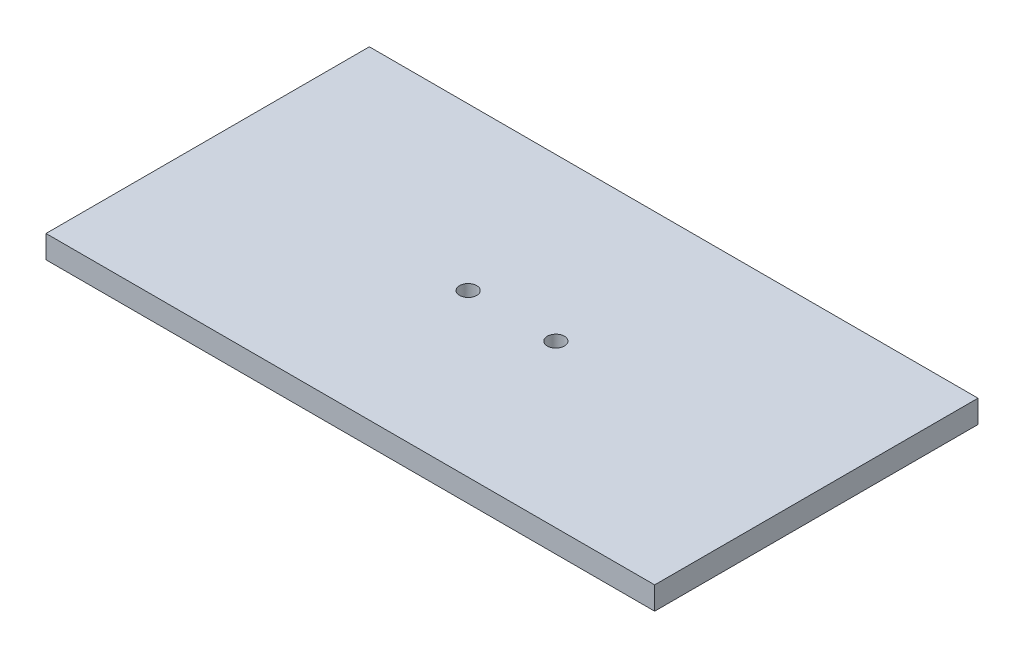
ISO-10303-21;
HEADER;
FILE_DESCRIPTION(('STEP AP214'),'2;1');
FILE_NAME('part.step','',(''),(''),'','','');
FILE_SCHEMA(('AUTOMOTIVE_DESIGN { 1 0 10303 214 1 1 1 1 }'));
ENDSEC;
DATA;
#1=APPLICATION_CONTEXT('core data for automotive mechanical design processes');
#2=APPLICATION_PROTOCOL_DEFINITION('international standard','automotive_design',2000,#1);
#3=PRODUCT_CONTEXT('',#1,'mechanical');
#4=PRODUCT('Part','Part','',(#3));
#5=PRODUCT_RELATED_PRODUCT_CATEGORY('part','',(#4));
#6=PRODUCT_DEFINITION_FORMATION('','',#4);
#7=PRODUCT_DEFINITION_CONTEXT('part definition',#1,'design');
#8=PRODUCT_DEFINITION('design','',#6,#7);
#9=PRODUCT_DEFINITION_SHAPE('','',#8);
#10=(LENGTH_UNIT() NAMED_UNIT(*) SI_UNIT(.MILLI.,.METRE.));
#11=(NAMED_UNIT(*) PLANE_ANGLE_UNIT() SI_UNIT($,.RADIAN.));
#12=(NAMED_UNIT(*) SI_UNIT($,.STERADIAN.) SOLID_ANGLE_UNIT());
#13=UNCERTAINTY_MEASURE_WITH_UNIT(LENGTH_MEASURE(1.E-05),#10,'distance_accuracy_value','');
#14=(GEOMETRIC_REPRESENTATION_CONTEXT(3) GLOBAL_UNCERTAINTY_ASSIGNED_CONTEXT((#13)) GLOBAL_UNIT_ASSIGNED_CONTEXT((#10,
#11,#12)) REPRESENTATION_CONTEXT('',''));
#15=CARTESIAN_POINT('',(0.,0.,0.));
#16=DIRECTION('',(0.,0.,1.));
#17=DIRECTION('',(1.,0.,0.));
#18=AXIS2_PLACEMENT_3D('',#15,#16,#17);
#19=CARTESIAN_POINT('',(160.,12.,85.));
#20=DIRECTION('',(-1.,0.,0.));
#21=DIRECTION('',(0.,0.,1.));
#22=AXIS2_PLACEMENT_3D('',#19,#20,#21);
#23=PLANE('',#22);
#24=DIRECTION('',(0.,0.,-1.));
#25=VECTOR('',#24,1.);
#26=CARTESIAN_POINT('',(160.,0.,85.));
#27=LINE('',#26,#25);
#28=CARTESIAN_POINT('',(160.,0.,85.));
#29=VERTEX_POINT('',#28);
#30=CARTESIAN_POINT('',(160.,0.,-85.));
#31=VERTEX_POINT('',#30);
#32=EDGE_CURVE('E96',#29,#31,#27,.T.);
#33=ORIENTED_EDGE('',*,*,#32,.T.);
#34=DIRECTION('',(0.,-1.,0.));
#35=VECTOR('',#34,1.);
#36=CARTESIAN_POINT('',(160.,12.,-85.));
#37=LINE('',#36,#35);
#38=CARTESIAN_POINT('',(160.,12.,-85.));
#39=VERTEX_POINT('',#38);
#40=EDGE_CURVE('E11',#39,#31,#37,.T.);
#41=ORIENTED_EDGE('',*,*,#40,.F.);
#42=DIRECTION('',(0.,0.,-1.));
#43=VECTOR('',#42,1.);
#44=CARTESIAN_POINT('',(160.,12.,85.));
#45=LINE('',#44,#43);
#46=CARTESIAN_POINT('',(160.,12.,85.));
#47=VERTEX_POINT('',#46);
#48=EDGE_CURVE('E84',#47,#39,#45,.T.);
#49=ORIENTED_EDGE('',*,*,#48,.F.);
#50=DIRECTION('',(0.,-1.,0.));
#51=VECTOR('',#50,1.);
#52=CARTESIAN_POINT('',(160.,12.,85.));
#53=LINE('',#52,#51);
#54=EDGE_CURVE('E92',#47,#29,#53,.T.);
#55=ORIENTED_EDGE('',*,*,#54,.T.);
#56=EDGE_LOOP('',(#33,#41,#49,#55));
#57=FACE_BOUND('',#56,.T.);
#58=ADVANCED_FACE('F33',(#57),#23,.F.);
#59=CARTESIAN_POINT('',(-160.,12.,-85.));
#60=DIRECTION('',(0.,0.,1.));
#61=DIRECTION('',(1.,0.,0.));
#62=AXIS2_PLACEMENT_3D('',#59,#60,#61);
#63=PLANE('',#62);
#64=DIRECTION('',(-1.,0.,0.));
#65=VECTOR('',#64,1.);
#66=CARTESIAN_POINT('',(-160.,0.,-85.));
#67=LINE('',#66,#65);
#68=CARTESIAN_POINT('',(-160.,0.,-85.));
#69=VERTEX_POINT('',#68);
#70=EDGE_CURVE('E88',#31,#69,#67,.T.);
#71=ORIENTED_EDGE('',*,*,#70,.T.);
#72=DIRECTION('',(0.,-1.,0.));
#73=VECTOR('',#72,1.);
#74=CARTESIAN_POINT('',(-160.,12.,-85.));
#75=LINE('',#74,#73);
#76=CARTESIAN_POINT('',(-160.,12.,-85.));
#77=VERTEX_POINT('',#76);
#78=EDGE_CURVE('E41',#77,#69,#75,.T.);
#79=ORIENTED_EDGE('',*,*,#78,.F.);
#80=DIRECTION('',(-1.,0.,0.));
#81=VECTOR('',#80,1.);
#82=CARTESIAN_POINT('',(-160.,12.,-85.));
#83=LINE('',#82,#81);
#84=EDGE_CURVE('E79',#39,#77,#83,.T.);
#85=ORIENTED_EDGE('',*,*,#84,.F.);
#86=ORIENTED_EDGE('',*,*,#40,.T.);
#87=EDGE_LOOP('',(#71,#79,#85,#86));
#88=FACE_BOUND('',#87,.T.);
#89=ADVANCED_FACE('F87',(#88),#63,.F.);
#90=CARTESIAN_POINT('',(-160.,12.,85.));
#91=DIRECTION('',(1.,0.,0.));
#92=DIRECTION('',(0.,0.,-1.));
#93=AXIS2_PLACEMENT_3D('',#90,#91,#92);
#94=PLANE('',#93);
#95=DIRECTION('',(0.,0.,1.));
#96=VECTOR('',#95,1.);
#97=CARTESIAN_POINT('',(-160.,0.,85.));
#98=LINE('',#97,#96);
#99=CARTESIAN_POINT('',(-160.,0.,85.));
#100=VERTEX_POINT('',#99);
#101=EDGE_CURVE('E66',#69,#100,#98,.T.);
#102=ORIENTED_EDGE('',*,*,#101,.T.);
#103=DIRECTION('',(0.,-1.,0.));
#104=VECTOR('',#103,1.);
#105=CARTESIAN_POINT('',(-160.,12.,85.));
#106=LINE('',#105,#104);
#107=CARTESIAN_POINT('',(-160.,12.,85.));
#108=VERTEX_POINT('',#107);
#109=EDGE_CURVE('E89',#108,#100,#106,.T.);
#110=ORIENTED_EDGE('',*,*,#109,.F.);
#111=DIRECTION('',(0.,0.,1.));
#112=VECTOR('',#111,1.);
#113=CARTESIAN_POINT('',(-160.,12.,85.));
#114=LINE('',#113,#112);
#115=EDGE_CURVE('E82',#77,#108,#114,.T.);
#116=ORIENTED_EDGE('',*,*,#115,.F.);
#117=ORIENTED_EDGE('',*,*,#78,.T.);
#118=EDGE_LOOP('',(#102,#110,#116,#117));
#119=FACE_BOUND('',#118,.T.);
#120=ADVANCED_FACE('F90',(#119),#94,.F.);
#121=CARTESIAN_POINT('',(-160.,12.,85.));
#122=DIRECTION('',(0.,0.,-1.));
#123=DIRECTION('',(-1.,0.,0.));
#124=AXIS2_PLACEMENT_3D('',#121,#122,#123);
#125=PLANE('',#124);
#126=DIRECTION('',(1.,0.,0.));
#127=VECTOR('',#126,1.);
#128=CARTESIAN_POINT('',(-160.,0.,85.));
#129=LINE('',#128,#127);
#130=EDGE_CURVE('E72',#100,#29,#129,.T.);
#131=ORIENTED_EDGE('',*,*,#130,.T.);
#132=ORIENTED_EDGE('',*,*,#54,.F.);
#133=DIRECTION('',(1.,0.,0.));
#134=VECTOR('',#133,1.);
#135=CARTESIAN_POINT('',(-160.,12.,85.));
#136=LINE('',#135,#134);
#137=EDGE_CURVE('E49',#108,#47,#136,.T.);
#138=ORIENTED_EDGE('',*,*,#137,.F.);
#139=ORIENTED_EDGE('',*,*,#109,.T.);
#140=EDGE_LOOP('',(#131,#132,#138,#139));
#141=FACE_BOUND('',#140,.T.);
#142=ADVANCED_FACE('F104',(#141),#125,.F.);
#143=CARTESIAN_POINT('',(0.,12.,0.));
#144=DIRECTION('',(0.,-1.,0.));
#145=DIRECTION('',(0.,0.,-1.));
#146=AXIS2_PLACEMENT_3D('',#143,#144,#145);
#147=PLANE('',#146);
#148=CARTESIAN_POINT('',(23.05,12.,0.));
#149=DIRECTION('',(0.,-1.,0.));
#150=DIRECTION('',(0.,0.,-1.));
#151=AXIS2_PLACEMENT_3D('',#148,#149,#150);
#152=CIRCLE('',#151,4.5);
#153=CARTESIAN_POINT('',(23.05,12.,-4.5));
#154=VERTEX_POINT('',#153);
#155=EDGE_CURVE('E115',#154,#154,#152,.T.);
#156=ORIENTED_EDGE('',*,*,#155,.T.);
#157=EDGE_LOOP('',(#156));
#158=FACE_BOUND('',#157,.T.);
#159=CARTESIAN_POINT('',(-23.05,12.,0.));
#160=DIRECTION('',(0.,-1.,0.));
#161=DIRECTION('',(0.,0.,-1.));
#162=AXIS2_PLACEMENT_3D('',#159,#160,#161);
#163=CIRCLE('',#162,4.5);
#164=CARTESIAN_POINT('',(-23.05,12.,-4.5));
#165=VERTEX_POINT('',#164);
#166=EDGE_CURVE('E99',#165,#165,#163,.T.);
#167=ORIENTED_EDGE('',*,*,#166,.T.);
#168=EDGE_LOOP('',(#167));
#169=FACE_BOUND('',#168,.T.);
#170=ORIENTED_EDGE('',*,*,#48,.T.);
#171=ORIENTED_EDGE('',*,*,#84,.T.);
#172=ORIENTED_EDGE('',*,*,#115,.T.);
#173=ORIENTED_EDGE('',*,*,#137,.T.);
#174=EDGE_LOOP('',(#170,#171,#172,#173));
#175=FACE_BOUND('',#174,.T.);
#176=ADVANCED_FACE('F80',(#158,#169,#175),#147,.F.);
#177=CARTESIAN_POINT('',(0.,0.,0.));
#178=DIRECTION('',(0.,-1.,0.));
#179=DIRECTION('',(0.,0.,-1.));
#180=AXIS2_PLACEMENT_3D('',#177,#178,#179);
#181=PLANE('',#180);
#182=CARTESIAN_POINT('',(23.05,0.,0.));
#183=DIRECTION('',(0.,1.,0.));
#184=DIRECTION('',(0.,0.,1.));
#185=AXIS2_PLACEMENT_3D('',#182,#183,#184);
#186=CIRCLE('',#185,4.5);
#187=CARTESIAN_POINT('',(23.05,0.,4.5));
#188=VERTEX_POINT('',#187);
#189=EDGE_CURVE('E118',#188,#188,#186,.T.);
#190=ORIENTED_EDGE('',*,*,#189,.T.);
#191=EDGE_LOOP('',(#190));
#192=FACE_BOUND('',#191,.T.);
#193=CARTESIAN_POINT('',(-23.05,0.,0.));
#194=DIRECTION('',(0.,1.,0.));
#195=DIRECTION('',(0.,0.,1.));
#196=AXIS2_PLACEMENT_3D('',#193,#194,#195);
#197=CIRCLE('',#196,4.5);
#198=CARTESIAN_POINT('',(-23.05,0.,4.5));
#199=VERTEX_POINT('',#198);
#200=EDGE_CURVE('E112',#199,#199,#197,.T.);
#201=ORIENTED_EDGE('',*,*,#200,.T.);
#202=EDGE_LOOP('',(#201));
#203=FACE_BOUND('',#202,.T.);
#204=ORIENTED_EDGE('',*,*,#32,.F.);
#205=ORIENTED_EDGE('',*,*,#130,.F.);
#206=ORIENTED_EDGE('',*,*,#101,.F.);
#207=ORIENTED_EDGE('',*,*,#70,.F.);
#208=EDGE_LOOP('',(#204,#205,#206,#207));
#209=FACE_BOUND('',#208,.T.);
#210=ADVANCED_FACE('F107',(#192,#203,#209),#181,.T.);
#211=CARTESIAN_POINT('',(-23.05,0.,0.));
#212=DIRECTION('',(0.,1.,0.));
#213=DIRECTION('',(0.,0.,1.));
#214=AXIS2_PLACEMENT_3D('',#211,#212,#213);
#215=CYLINDRICAL_SURFACE('',#214,4.5);
#216=ORIENTED_EDGE('',*,*,#200,.F.);
#217=EDGE_LOOP('',(#216));
#218=FACE_BOUND('',#217,.T.);
#219=ORIENTED_EDGE('',*,*,#166,.F.);
#220=EDGE_LOOP('',(#219));
#221=FACE_BOUND('',#220,.T.);
#222=ADVANCED_FACE('F127',(#218,#221),#215,.F.);
#223=CARTESIAN_POINT('',(23.05,0.,0.));
#224=DIRECTION('',(0.,1.,0.));
#225=DIRECTION('',(0.,0.,1.));
#226=AXIS2_PLACEMENT_3D('',#223,#224,#225);
#227=CYLINDRICAL_SURFACE('',#226,4.5);
#228=ORIENTED_EDGE('',*,*,#189,.F.);
#229=EDGE_LOOP('',(#228));
#230=FACE_BOUND('',#229,.T.);
#231=ORIENTED_EDGE('',*,*,#155,.F.);
#232=EDGE_LOOP('',(#231));
#233=FACE_BOUND('',#232,.T.);
#234=ADVANCED_FACE('F124',(#230,#233),#227,.F.);
#235=CLOSED_SHELL('',(#58,#89,#120,#142,#176,#210,#222,#234));
#236=MANIFOLD_SOLID_BREP('B2',#235);
#237=ADVANCED_BREP_SHAPE_REPRESENTATION('',(#18,#236),#14);
#238=SHAPE_DEFINITION_REPRESENTATION(#9,#237);
ENDSEC;
END-ISO-10303-21;
